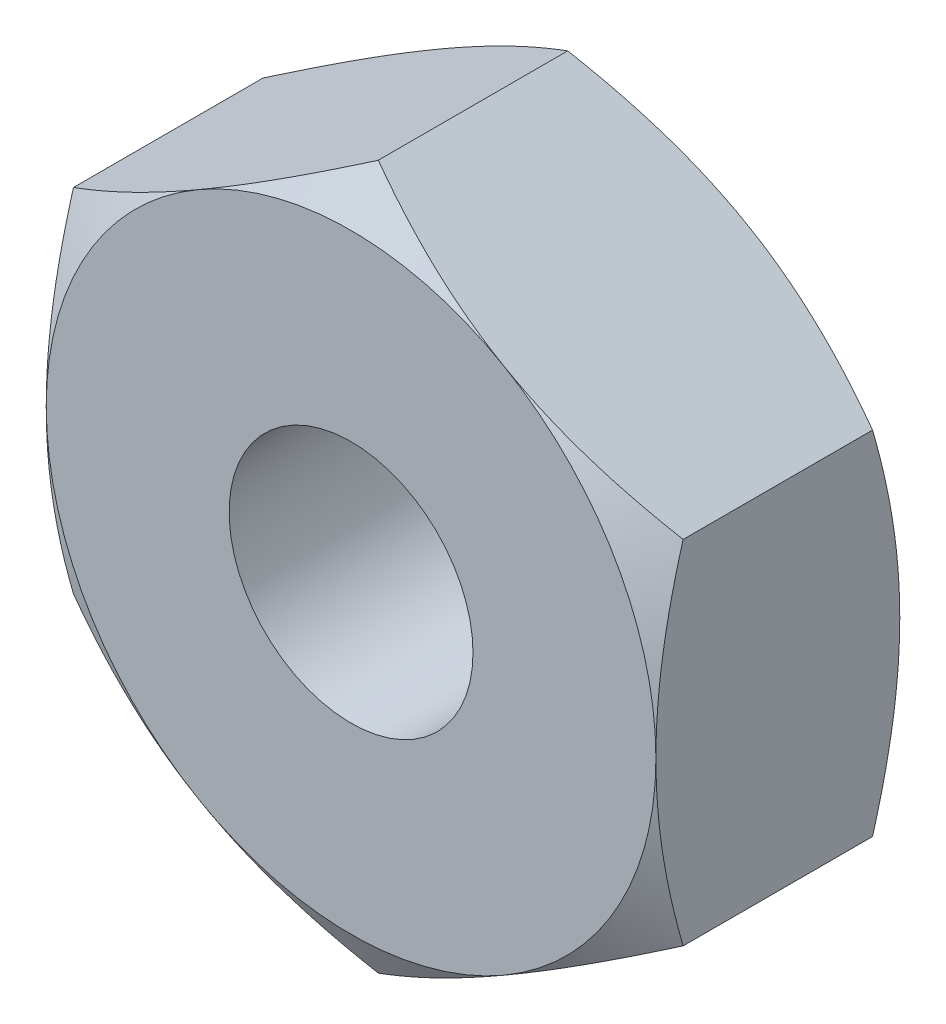
ISO-10303-21;
HEADER;
FILE_DESCRIPTION(('STEP AP214'),'2;1');
FILE_NAME('part.step','',(''),(''),'','','');
FILE_SCHEMA(('AUTOMOTIVE_DESIGN { 1 0 10303 214 1 1 1 1 }'));
ENDSEC;
DATA;
#1=APPLICATION_CONTEXT('core data for automotive mechanical design processes');
#2=APPLICATION_PROTOCOL_DEFINITION('international standard','automotive_design',2000,#1);
#3=PRODUCT_CONTEXT('',#1,'mechanical');
#4=PRODUCT('Part','Part','',(#3));
#5=PRODUCT_RELATED_PRODUCT_CATEGORY('part','',(#4));
#6=PRODUCT_DEFINITION_FORMATION('','',#4);
#7=PRODUCT_DEFINITION_CONTEXT('part definition',#1,'design');
#8=PRODUCT_DEFINITION('design','',#6,#7);
#9=PRODUCT_DEFINITION_SHAPE('','',#8);
#10=(LENGTH_UNIT() NAMED_UNIT(*) SI_UNIT(.MILLI.,.METRE.));
#11=(NAMED_UNIT(*) PLANE_ANGLE_UNIT() SI_UNIT($,.RADIAN.));
#12=(NAMED_UNIT(*) SI_UNIT($,.STERADIAN.) SOLID_ANGLE_UNIT());
#13=UNCERTAINTY_MEASURE_WITH_UNIT(LENGTH_MEASURE(1.E-05),#10,'distance_accuracy_value','');
#14=(GEOMETRIC_REPRESENTATION_CONTEXT(3) GLOBAL_UNCERTAINTY_ASSIGNED_CONTEXT((#13)) GLOBAL_UNIT_ASSIGNED_CONTEXT((#10,
#11,#12)) REPRESENTATION_CONTEXT('',''));
#15=CARTESIAN_POINT('',(0.,0.,0.));
#16=DIRECTION('',(0.,0.,1.));
#17=DIRECTION('',(1.,0.,0.));
#18=AXIS2_PLACEMENT_3D('',#15,#16,#17);
#19=CARTESIAN_POINT('',(-2.49999999999997,-1.44337567297409,2.));
#20=DIRECTION('',(0.499999999999995,0.866025403784441,0.));
#21=DIRECTION('',(-0.866025403784442,0.499999999999995,0.));
#22=AXIS2_PLACEMENT_3D('',#19,#20,#21);
#23=PLANE('',#22);
#24=CARTESIAN_POINT('',(0.000200000000000162,-2.88686681600195,0.2233576643591));
#25=CARTESIAN_POINT('',(-0.109663234734871,-2.82343724785373,0.186721620107618));
#26=CARTESIAN_POINT('',(-0.220474799896525,-2.75946016087833,0.153402218965049));
#27=CARTESIAN_POINT('',(-0.444016833466049,-2.63039810762177,0.0952422855578519));
#28=CARTESIAN_POINT('',(-0.556751274528388,-2.56531084772749,0.0704223291477331));
#29=CARTESIAN_POINT('',(-0.780822993875268,-2.43594298024479,0.0317856514410478));
#30=CARTESIAN_POINT('',(-0.892125791767376,-2.37168227992022,0.0177117961856351));
#31=CARTESIAN_POINT('',(-1.11525522746833,-2.24285844015414,0.000909152352747347));
#32=CARTESIAN_POINT('',(-1.22708105401423,-2.17829576909552,-0.00183354879637574));
#33=CARTESIAN_POINT('',(-1.43604197555152,-2.05765212479586,0.00386576000805192));
#34=CARTESIAN_POINT('',(-1.53320831755773,-2.0015531110824,0.0109083943818601));
#35=CARTESIAN_POINT('',(-1.72690794971099,-1.88972057631678,0.0332314191249406));
#36=CARTESIAN_POINT('',(-1.82344056965972,-1.83398744220381,0.0485194384402649));
#37=CARTESIAN_POINT('',(-2.01753972174046,-1.72192424450051,0.086739093844417));
#38=CARTESIAN_POINT('',(-2.11508168178212,-1.66560836761318,0.109832776125513));
#39=CARTESIAN_POINT('',(-2.30871060807606,-1.55381665489447,0.162246656577907));
#40=CARTESIAN_POINT('',(-2.40480005588615,-1.49833938633504,0.191554535624541));
#41=CARTESIAN_POINT('',(-2.50019999999997,-1.44326020292025,0.2233576643591));
#42=B_SPLINE_CURVE_WITH_KNOTS('',3,(#24,#25,#26,#27,#28,#29,#30,#31,#32,#33,#34,#35,#36,#37,#38,
#39,#40,#41),.UNSPECIFIED.,.F.,.F.,(4,2,2,2,2,2,2,2,4),(0.,0.396285827362224,0.793524330152047,
1.18093086852113,1.56786160134475,1.90479741793731,2.2420455166046,2.58677531536753,
2.93082800105252),.UNSPECIFIED.);
#43=CARTESIAN_POINT('',(0.,-2.88675134594811,0.223290993692593));
#44=VERTEX_POINT('',#43);
#45=CARTESIAN_POINT('',(-1.24999999999999,-2.1650635094611,0.));
#46=VERTEX_POINT('',#45);
#47=EDGE_CURVE('E266',#44,#46,#42,.T.);
#48=ORIENTED_EDGE('',*,*,#47,.F.);
#49=DIRECTION('',(0.,0.,-1.));
#50=VECTOR('',#49,1.);
#51=CARTESIAN_POINT('',(0.,-2.88675134594811,2.));
#52=LINE('',#51,#50);
#53=CARTESIAN_POINT('',(0.,-2.88675134594811,1.77670900630741));
#54=VERTEX_POINT('',#53);
#55=EDGE_CURVE('E309',#54,#44,#52,.T.);
#56=ORIENTED_EDGE('',*,*,#55,.F.);
#57=CARTESIAN_POINT('',(-2.50019999999997,-1.44326020292025,1.7766423356409));
#58=CARTESIAN_POINT('',(-2.3903367652651,-1.50668977106847,1.81327837989238));
#59=CARTESIAN_POINT('',(-2.27952520010345,-1.57066685804387,1.84659778103495));
#60=CARTESIAN_POINT('',(-2.05598316653392,-1.69972891130043,1.90475771444215));
#61=CARTESIAN_POINT('',(-1.94324872547158,-1.76481617119471,1.92957767085227));
#62=CARTESIAN_POINT('',(-1.7191770061247,-1.89418403867742,1.96821434855895));
#63=CARTESIAN_POINT('',(-1.60787420823259,-1.95844473900198,1.98228820381436));
#64=CARTESIAN_POINT('',(-1.38474477253164,-2.08726857876806,1.99909084764725));
#65=CARTESIAN_POINT('',(-1.27291894598575,-2.15183124982668,2.00183354879638));
#66=CARTESIAN_POINT('',(-1.06395802444845,-2.27247489412635,1.99613423999195));
#67=CARTESIAN_POINT('',(-0.966791682442246,-2.3285739078398,1.98909160561814));
#68=CARTESIAN_POINT('',(-0.773092050288979,-2.44040644260542,1.96676858087506));
#69=CARTESIAN_POINT('',(-0.676559430340252,-2.4961395767184,1.95148056155974));
#70=CARTESIAN_POINT('',(-0.482460278259513,-2.60820277442169,1.91326090615558));
#71=CARTESIAN_POINT('',(-0.38491831821785,-2.66451865130902,1.89016722387449));
#72=CARTESIAN_POINT('',(-0.19128939192391,-2.77631036402773,1.83775334342209));
#73=CARTESIAN_POINT('',(-0.0951999441138213,-2.83178763258716,1.80844546437546));
#74=CARTESIAN_POINT('',(0.000200000000000241,-2.88686681600195,1.7766423356409));
#75=B_SPLINE_CURVE_WITH_KNOTS('',3,(#57,#58,#59,#60,#61,#62,#63,#64,#65,#66,#67,#68,#69,#70,#71,
#72,#73,#74),.UNSPECIFIED.,.F.,.F.,(4,2,2,2,2,2,2,2,4),(0.,0.396285827362225,0.793524330152047,
1.18093086852113,1.56786160134475,1.90479741793731,2.2420455166046,2.58677531536753,
2.93082800105252),.UNSPECIFIED.);
#76=CARTESIAN_POINT('',(-1.24999999999999,-2.1650635094611,2.));
#77=VERTEX_POINT('',#76);
#78=EDGE_CURVE('E216',#77,#54,#75,.T.);
#79=ORIENTED_EDGE('',*,*,#78,.F.);
#80=CARTESIAN_POINT('',(-2.49999999999997,-1.44337567297421,1.77670900630749));
#81=VERTEX_POINT('',#80);
#82=EDGE_CURVE('E292',#81,#77,#75,.T.);
#83=ORIENTED_EDGE('',*,*,#82,.F.);
#84=DIRECTION('',(0.,0.,-1.));
#85=VECTOR('',#84,1.);
#86=CARTESIAN_POINT('',(-2.49999999999997,-1.44337567297409,2.));
#87=LINE('',#86,#85);
#88=CARTESIAN_POINT('',(-2.49999999999997,-1.44337567297421,0.223290993692512));
#89=VERTEX_POINT('',#88);
#90=EDGE_CURVE('E289',#81,#89,#87,.T.);
#91=ORIENTED_EDGE('',*,*,#90,.T.);
#92=EDGE_CURVE('E253',#46,#89,#42,.T.);
#93=ORIENTED_EDGE('',*,*,#92,.F.);
#94=EDGE_LOOP('',(#48,#56,#79,#83,#91,#93));
#95=FACE_BOUND('',#94,.T.);
#96=ADVANCED_FACE('F36',(#95),#23,.F.);
#97=CARTESIAN_POINT('',(0.,-2.88675134594811,2.));
#98=DIRECTION('',(-0.500000000000001,0.866025403784438,0.));
#99=DIRECTION('',(-0.866025403784438,-0.500000000000001,0.));
#100=AXIS2_PLACEMENT_3D('',#97,#98,#99);
#101=PLANE('',#100);
#102=CARTESIAN_POINT('',(2.50019999999999,-1.44326020292021,0.2233576643591));
#103=CARTESIAN_POINT('',(2.39033676526512,-1.50668977106843,0.186721620107618));
#104=CARTESIAN_POINT('',(2.27952520010347,-1.57066685804384,0.153402218965048));
#105=CARTESIAN_POINT('',(2.05598316653394,-1.6997289113004,0.0952422855578497));
#106=CARTESIAN_POINT('',(1.94324872547161,-1.76481617119468,0.0704223291477302));
#107=CARTESIAN_POINT('',(1.71917700612473,-1.89418403867739,0.0317856514410439));
#108=CARTESIAN_POINT('',(1.60787420823262,-1.95844473900195,0.0177117961856309));
#109=CARTESIAN_POINT('',(1.38474477253166,-2.08726857876803,0.000909152352742216));
#110=CARTESIAN_POINT('',(1.27291894598577,-2.15183124982665,-0.00183354879638143));
#111=CARTESIAN_POINT('',(1.06395802444848,-2.27247489412632,0.00386576000804523));
#112=CARTESIAN_POINT('',(0.966791682442268,-2.32857390783978,0.0109083943818532));
#113=CARTESIAN_POINT('',(0.773092050288997,-2.4404064426054,0.033231419124934));
#114=CARTESIAN_POINT('',(0.676559430340268,-2.49613957671838,0.0485194384402587));
#115=CARTESIAN_POINT('',(0.482460278259524,-2.60820277442168,0.0867390938444119));
#116=CARTESIAN_POINT('',(0.384918318217859,-2.66451865130902,0.109832776125509));
#117=CARTESIAN_POINT('',(0.191289391923915,-2.77631036402772,0.162246656577905));
#118=CARTESIAN_POINT('',(0.0951999441138241,-2.83178763258716,0.19155453562454));
#119=CARTESIAN_POINT('',(-0.000199999999999883,-2.88686681600195,0.2233576643591));
#120=B_SPLINE_CURVE_WITH_KNOTS('',3,(#102,#103,#104,#105,#106,#107,#108,#109,#110,#111,#112,
#113,#114,#115,#116,#117,#118,#119),.UNSPECIFIED.,.F.,.F.,(4,2,2,2,2,2,2,2,4),(0.,
0.396285827362225,0.793524330152047,1.18093086852113,1.56786160134475,1.90479741793732,
2.24204551660462,2.58677531536755,2.93082800105256),.UNSPECIFIED.);
#121=CARTESIAN_POINT('',(2.49999999999999,-1.44337567297405,0.223290993692593));
#122=VERTEX_POINT('',#121);
#123=CARTESIAN_POINT('',(1.25,-2.1650635094611,0.));
#124=VERTEX_POINT('',#123);
#125=EDGE_CURVE('E144',#122,#124,#120,.T.);
#126=ORIENTED_EDGE('',*,*,#125,.F.);
#127=DIRECTION('',(0.,0.,-1.));
#128=VECTOR('',#127,1.);
#129=CARTESIAN_POINT('',(2.49999999999999,-1.44337567297405,2.));
#130=LINE('',#129,#128);
#131=CARTESIAN_POINT('',(2.49999999999999,-1.44337567297417,1.77670900630749));
#132=VERTEX_POINT('',#131);
#133=EDGE_CURVE('E156',#132,#122,#130,.T.);
#134=ORIENTED_EDGE('',*,*,#133,.F.);
#135=CARTESIAN_POINT('',(-0.000200000000000074,-2.88686681600195,1.7766423356409));
#136=CARTESIAN_POINT('',(0.10966323473487,-2.82343724785373,1.81327837989238));
#137=CARTESIAN_POINT('',(0.220474799896524,-2.75946016087833,1.84659778103495));
#138=CARTESIAN_POINT('',(0.444016833466047,-2.63039810762177,1.90475771444215));
#139=CARTESIAN_POINT('',(0.556751274528385,-2.56531084772748,1.92957767085227));
#140=CARTESIAN_POINT('',(0.780822993875264,-2.43594298024478,1.96821434855896));
#141=CARTESIAN_POINT('',(0.892125791767372,-2.37168227992021,1.98228820381437));
#142=CARTESIAN_POINT('',(1.11525522746833,-2.24285844015414,1.99909084764726));
#143=CARTESIAN_POINT('',(1.22708105401422,-2.17829576909551,2.00183354879638));
#144=CARTESIAN_POINT('',(1.43604197555151,-2.05765212479585,1.99613423999195));
#145=CARTESIAN_POINT('',(1.53320831755772,-2.00155311108239,1.98909160561815));
#146=CARTESIAN_POINT('',(1.72690794971099,-1.88972057631677,1.96676858087507));
#147=CARTESIAN_POINT('',(1.82344056965972,-1.83398744220379,1.95148056155974));
#148=CARTESIAN_POINT('',(2.01753972174047,-1.72192424450049,1.91326090615559));
#149=CARTESIAN_POINT('',(2.11508168178213,-1.66560836761315,1.89016722387449));
#150=CARTESIAN_POINT('',(2.30871060807608,-1.55381665489444,1.8377533434221));
#151=CARTESIAN_POINT('',(2.40480005588617,-1.49833938633501,1.80844546437546));
#152=CARTESIAN_POINT('',(2.50019999999999,-1.44326020292021,1.7766423356409));
#153=B_SPLINE_CURVE_WITH_KNOTS('',3,(#135,#136,#137,#138,#139,#140,#141,#142,#143,#144,#145,
#146,#147,#148,#149,#150,#151,#152),.UNSPECIFIED.,.F.,.F.,(4,2,2,2,2,2,2,2,4),(0.,
0.396285827362224,0.793524330152047,1.18093086852113,1.56786160134475,1.90479741793732,
2.24204551660462,2.58677531536755,2.93082800105256),.UNSPECIFIED.);
#154=CARTESIAN_POINT('',(1.25,-2.16506350946108,2.));
#155=VERTEX_POINT('',#154);
#156=EDGE_CURVE('E199',#155,#132,#153,.T.);
#157=ORIENTED_EDGE('',*,*,#156,.F.);
#158=EDGE_CURVE('E333',#54,#155,#153,.T.);
#159=ORIENTED_EDGE('',*,*,#158,.F.);
#160=ORIENTED_EDGE('',*,*,#55,.T.);
#161=EDGE_CURVE('E166',#124,#44,#120,.T.);
#162=ORIENTED_EDGE('',*,*,#161,.F.);
#163=EDGE_LOOP('',(#126,#134,#157,#159,#160,#162));
#164=FACE_BOUND('',#163,.T.);
#165=ADVANCED_FACE('F179',(#164),#101,.F.);
#166=CARTESIAN_POINT('',(2.49999999999999,-1.44337567297405,2.));
#167=DIRECTION('',(-1.,0.,0.));
#168=DIRECTION('',(0.,-1.,0.));
#169=AXIS2_PLACEMENT_3D('',#166,#167,#168);
#170=PLANE('',#169);
#171=CARTESIAN_POINT('',(2.5,-3.93425573570174,1.24786742231988));
#172=CARTESIAN_POINT('',(2.5,-3.82455805271518,1.19442683286789));
#173=CARTESIAN_POINT('',(2.5,-3.71461458124995,1.1414824250811));
#174=CARTESIAN_POINT('',(2.5,-3.49410553801961,1.03686398179162));
#175=CARTESIAN_POINT('',(2.5,-3.38353987636771,0.985190135952728));
#176=CARTESIAN_POINT('',(2.5,-3.1611133721341,0.883143029913734));
#177=CARTESIAN_POINT('',(2.5,-3.04924878665415,0.832777900698826));
#178=CARTESIAN_POINT('',(2.5,-2.8246495074574,0.734034164431113));
#179=CARTESIAN_POINT('',(2.5,-2.71191485354297,0.685655467138938));
#180=CARTESIAN_POINT('',(2.49999999999999,-2.4815726289783,0.589816347587659));
#181=CARTESIAN_POINT('',(2.49999999999999,-2.36392903093314,0.542442056681136));
#182=CARTESIAN_POINT('',(2.49999999999999,-2.12728680673992,0.451142480581939));
#183=CARTESIAN_POINT('',(2.49999999999999,-2.00828803339158,0.407217574235718));
#184=CARTESIAN_POINT('',(2.49999999999999,-1.76895086303134,0.323927966543298));
#185=CARTESIAN_POINT('',(2.49999999999999,-1.64861554144244,0.284554513885219));
#186=CARTESIAN_POINT('',(2.49999999999999,-1.40621964850133,0.21159319438697));
#187=CARTESIAN_POINT('',(2.49999999999999,-1.28415961496497,0.178003565258964));
#188=CARTESIAN_POINT('',(2.49999999999999,-1.0389195188697,0.118361804718263));
#189=CARTESIAN_POINT('',(2.49999999999999,-0.915749874741587,0.0922676059427502));
#190=CARTESIAN_POINT('',(2.49999999999999,-0.667820858109997,0.0490550373819117));
#191=CARTESIAN_POINT('',(2.49999999999999,-0.543061659325973,0.0319356952253109));
#192=CARTESIAN_POINT('',(2.49999999999999,-0.294229286789481,0.00825976303698975));
#193=CARTESIAN_POINT('',(2.49999999999999,-0.170169796196182,0.0015629187993084));
#194=CARTESIAN_POINT('',(2.49999999999999,0.0780766731615942,-0.00107330125971436));
#195=CARTESIAN_POINT('',(2.49999999999999,0.202263653840971,0.00298748693341116));
#196=CARTESIAN_POINT('',(2.49999999999998,0.411409604725348,0.0185927331632678));
#197=CARTESIAN_POINT('',(2.49999999999998,0.496584671497748,0.0274243081141329));
#198=CARTESIAN_POINT('',(2.49999999999998,0.666344730959548,0.0496284777980075));
#199=CARTESIAN_POINT('',(2.49999999999998,0.750929648415659,0.063001641083345));
#200=CARTESIAN_POINT('',(2.49999999999998,1.00366548007522,0.109234028667318));
#201=CARTESIAN_POINT('',(2.49999999999998,1.17071375552299,0.148199044449048));
#202=CARTESIAN_POINT('',(2.49999999999998,1.4206286514283,0.216203518781425));
#203=CARTESIAN_POINT('',(2.49999999999998,1.50477790209398,0.240801494595756));
#204=CARTESIAN_POINT('',(2.49999999999998,1.67225987920894,0.292660070165323));
#205=CARTESIAN_POINT('',(2.49999999999998,1.75559259937951,0.319920690377339));
#206=CARTESIAN_POINT('',(2.49999999999998,1.92146681890304,0.376658162164918));
#207=CARTESIAN_POINT('',(2.49999999999998,2.00400853495824,0.406134385980853));
#208=CARTESIAN_POINT('',(2.49999999999998,2.16840002368736,0.466945522238705));
#209=CARTESIAN_POINT('',(2.49999999999998,2.25024981200959,0.498280392517164));
#210=CARTESIAN_POINT('',(2.49999999999998,2.47007598379912,0.584843598085943));
#211=CARTESIAN_POINT('',(2.49999999999998,2.60747896260624,0.641526709598319));
#212=CARTESIAN_POINT('',(2.49999999999998,2.88087320813983,0.758212721815775));
#213=CARTESIAN_POINT('',(2.49999999999998,3.01686431759797,0.818215987739867));
#214=CARTESIAN_POINT('',(2.49999999999997,3.28775371033888,0.940755016909798));
#215=CARTESIAN_POINT('',(2.49999999999997,3.42265159883759,1.00329165002619));
#216=CARTESIAN_POINT('',(2.49999999999997,3.69153349617871,1.13030325926438));
#217=CARTESIAN_POINT('',(2.49999999999997,3.82551747693042,1.19477829464024));
#218=CARTESIAN_POINT('',(2.49999999999997,4.22678780318403,1.39065285591914));
#219=CARTESIAN_POINT('',(2.49999999999997,4.49297167508688,1.52430796749618));
#220=CARTESIAN_POINT('',(2.49999999999997,5.02332787108775,1.79538779124832));
#221=CARTESIAN_POINT('',(2.49999999999997,5.28750060208648,1.93281171353398));
#222=CARTESIAN_POINT('',(2.49999999999997,5.78669441053013,2.19560284746361));
#223=CARTESIAN_POINT('',(2.49999999999997,6.02185115865901,2.32071278514315));
#224=CARTESIAN_POINT('',(2.49999999999996,6.49137306636739,2.57244119196158));
#225=CARTESIAN_POINT('',(2.49999999999996,6.7257381764787,2.69905975321281));
#226=CARTESIAN_POINT('',(2.49999999999996,7.19307672107728,2.95299069470952));
#227=CARTESIAN_POINT('',(2.49999999999996,7.42605218847075,3.08029933799));
#228=CARTESIAN_POINT('',(2.49999999999996,7.89150863123006,3.33577450416362));
#229=CARTESIAN_POINT('',(2.49999999999996,8.12398964405185,3.46394095878685));
#230=CARTESIAN_POINT('',(2.49999999999996,8.35629687842252,3.59241944863064));
#231=B_SPLINE_CURVE_WITH_KNOTS('',3,(#171,#172,#173,#174,#175,#176,#177,#178,#179,#180,#181,
#182,#183,#184,#185,#186,#187,#188,#189,#190,#191,#192,#193,#194,#195,#196,#197,#198,#199,#200,
#201,#202,#203,#204,#205,#206,#207,#208,#209,#210,#211,#212,#213,#214,#215,#216,#217,#218,#219,
#220,#221,#222,#223,#224,#225,#226,#227,#228,#229,#230),.UNSPECIFIED.,.F.,.F.,(4,2,2,2,2,2,2,2,
2,2,2,2,2,2,2,2,2,2,2,2,2,2,2,2,2,2,2,2,2,4),(0.,0.366071555956611,0.732197429693603,
1.10022131466406,1.46822846255462,1.84865877257403,2.22913080704688,2.60885867248576,
2.98847063215674,3.36590845840163,3.74330538309199,4.11557841167118,4.4878571160823,
4.74462879425845,5.00143262902233,5.51529120295764,5.7782794978535,6.04126981341614,
6.30418589329148,6.56709601118611,7.01293774320754,7.45882861596655,7.9048739119297,
8.35093285672014,9.24444046413292,10.1377622149405,10.9368546431961,11.7359961144143,
12.5324647674532,13.3288707690047),.UNSPECIFIED.);
#232=CARTESIAN_POINT('',(2.49999999999998,1.44337567297407,0.223290993692593));
#233=VERTEX_POINT('',#232);
#234=CARTESIAN_POINT('',(2.5,0.,0.));
#235=VERTEX_POINT('',#234);
#236=EDGE_CURVE('E125',#233,#235,#231,.F.);
#237=ORIENTED_EDGE('',*,*,#236,.F.);
#238=DIRECTION('',(0.,0.,-1.));
#239=VECTOR('',#238,1.);
#240=CARTESIAN_POINT('',(2.49999999999998,1.44337567297407,2.));
#241=LINE('',#240,#239);
#242=CARTESIAN_POINT('',(2.49999999999998,1.44337567297407,1.77670900630741));
#243=VERTEX_POINT('',#242);
#244=EDGE_CURVE('E307',#243,#233,#241,.T.);
#245=ORIENTED_EDGE('',*,*,#244,.F.);
#246=CARTESIAN_POINT('',(2.5,-3.93425573570174,0.752132577680122));
#247=CARTESIAN_POINT('',(2.5,-3.82455805271518,0.805573167132106));
#248=CARTESIAN_POINT('',(2.5,-3.71461458124995,0.858517574918903));
#249=CARTESIAN_POINT('',(2.5,-3.49410553801961,0.96313601820838));
#250=CARTESIAN_POINT('',(2.5,-3.3835398763677,1.01480986404727));
#251=CARTESIAN_POINT('',(2.5,-3.1611133721341,1.11685697008627));
#252=CARTESIAN_POINT('',(2.5,-3.04924878665415,1.16722209930117));
#253=CARTESIAN_POINT('',(2.5,-2.8246495074574,1.26596583556889));
#254=CARTESIAN_POINT('',(2.5,-2.71191485354297,1.31434453286106));
#255=CARTESIAN_POINT('',(2.49999999999999,-2.4815726289783,1.41018365241234));
#256=CARTESIAN_POINT('',(2.49999999999999,-2.36392903093314,1.45755794331886));
#257=CARTESIAN_POINT('',(2.49999999999999,-2.12728680673992,1.54885751941806));
#258=CARTESIAN_POINT('',(2.49999999999999,-2.00828803339158,1.59278242576428));
#259=CARTESIAN_POINT('',(2.49999999999999,-1.76895086303134,1.6760720334567));
#260=CARTESIAN_POINT('',(2.49999999999999,-1.64861554144244,1.71544548611478));
#261=CARTESIAN_POINT('',(2.49999999999999,-1.40621964850133,1.78840680561303));
#262=CARTESIAN_POINT('',(2.49999999999999,-1.28415961496497,1.82199643474104));
#263=CARTESIAN_POINT('',(2.49999999999999,-1.0389195188697,1.88163819528174));
#264=CARTESIAN_POINT('',(2.49999999999999,-0.915749874741587,1.90773239405725));
#265=CARTESIAN_POINT('',(2.49999999999999,-0.667820858109997,1.95094496261809));
#266=CARTESIAN_POINT('',(2.49999999999999,-0.543061659325972,1.96806430477469));
#267=CARTESIAN_POINT('',(2.49999999999999,-0.294229286789481,1.99174023696301));
#268=CARTESIAN_POINT('',(2.49999999999999,-0.170169796196181,1.99843708120069));
#269=CARTESIAN_POINT('',(2.49999999999999,0.0780766731615949,2.00107330125971));
#270=CARTESIAN_POINT('',(2.49999999999999,0.202263653840971,1.99701251306659));
#271=CARTESIAN_POINT('',(2.49999999999998,0.411409604725348,1.98140726683673));
#272=CARTESIAN_POINT('',(2.49999999999998,0.496584671497748,1.97257569188587));
#273=CARTESIAN_POINT('',(2.49999999999998,0.666344730959547,1.95037152220199));
#274=CARTESIAN_POINT('',(2.49999999999998,0.750929648415658,1.93699835891666));
#275=CARTESIAN_POINT('',(2.49999999999998,1.00366548007522,1.89076597133268));
#276=CARTESIAN_POINT('',(2.49999999999998,1.17071375552299,1.85180095555095));
#277=CARTESIAN_POINT('',(2.49999999999998,1.4206286514283,1.78379648121857));
#278=CARTESIAN_POINT('',(2.49999999999998,1.50477790209398,1.75919850540424));
#279=CARTESIAN_POINT('',(2.49999999999998,1.67225987920894,1.70733992983468));
#280=CARTESIAN_POINT('',(2.49999999999998,1.75559259937951,1.68007930962266));
#281=CARTESIAN_POINT('',(2.49999999999998,1.92146681890304,1.62334183783508));
#282=CARTESIAN_POINT('',(2.49999999999998,2.00400853495824,1.59386561401915));
#283=CARTESIAN_POINT('',(2.49999999999998,2.16840002368736,1.53305447776129));
#284=CARTESIAN_POINT('',(2.49999999999998,2.25024981200959,1.50171960748284));
#285=CARTESIAN_POINT('',(2.49999999999998,2.47007598379913,1.41515640191406));
#286=CARTESIAN_POINT('',(2.49999999999998,2.60747896260624,1.35847329040168));
#287=CARTESIAN_POINT('',(2.49999999999998,2.88087320813983,1.24178727818422));
#288=CARTESIAN_POINT('',(2.49999999999998,3.01686431759797,1.18178401226013));
#289=CARTESIAN_POINT('',(2.49999999999997,3.28775371033888,1.0592449830902));
#290=CARTESIAN_POINT('',(2.49999999999997,3.42265159883759,0.996708349973814));
#291=CARTESIAN_POINT('',(2.49999999999997,3.69153349617871,0.86969674073562));
#292=CARTESIAN_POINT('',(2.49999999999997,3.82551747693042,0.805221705359762));
#293=CARTESIAN_POINT('',(2.49999999999997,4.22678780318403,0.609347144080856));
#294=CARTESIAN_POINT('',(2.49999999999997,4.49297167508688,0.475692032503817));
#295=CARTESIAN_POINT('',(2.49999999999997,5.02332787108775,0.204612208751678));
#296=CARTESIAN_POINT('',(2.49999999999997,5.28750060208648,0.0671882864660215));
#297=CARTESIAN_POINT('',(2.49999999999997,5.78669441053013,-0.195602847463607));
#298=CARTESIAN_POINT('',(2.49999999999997,6.02185115865901,-0.320712785143147));
#299=CARTESIAN_POINT('',(2.49999999999996,6.49137306636739,-0.572441191961576));
#300=CARTESIAN_POINT('',(2.49999999999996,6.7257381764787,-0.699059753212815));
#301=CARTESIAN_POINT('',(2.49999999999996,7.19307672107728,-0.952990694709516));
#302=CARTESIAN_POINT('',(2.49999999999996,7.42605218847075,-1.08029933799));
#303=CARTESIAN_POINT('',(2.49999999999996,7.89150863123006,-1.33577450416362));
#304=CARTESIAN_POINT('',(2.49999999999996,8.12398964405185,-1.46394095878685));
#305=CARTESIAN_POINT('',(2.49999999999996,8.35629687842252,-1.59241944863064));
#306=B_SPLINE_CURVE_WITH_KNOTS('',3,(#246,#247,#248,#249,#250,#251,#252,#253,#254,#255,#256,
#257,#258,#259,#260,#261,#262,#263,#264,#265,#266,#267,#268,#269,#270,#271,#272,#273,#274,#275,
#276,#277,#278,#279,#280,#281,#282,#283,#284,#285,#286,#287,#288,#289,#290,#291,#292,#293,#294,
#295,#296,#297,#298,#299,#300,#301,#302,#303,#304,#305),.UNSPECIFIED.,.F.,.F.,(4,2,2,2,2,2,2,2,
2,2,2,2,2,2,2,2,2,2,2,2,2,2,2,2,2,2,2,2,2,4),(0.,0.366071555956611,0.732197429693603,
1.10022131466407,1.46822846255462,1.84865877257403,2.22913080704688,2.60885867248576,
2.98847063215674,3.36590845840163,3.74330538309199,4.11557841167118,4.4878571160823,
4.74462879425845,5.00143262902233,5.51529120295764,5.7782794978535,6.04126981341614,
6.30418589329148,6.56709601118611,7.01293774320754,7.45882861596655,7.9048739119297,
8.35093285672014,9.24444046413292,10.1377622149405,10.9368546431961,11.7359961144143,
12.5324647674532,13.3288707690047),.UNSPECIFIED.);
#307=CARTESIAN_POINT('',(2.49999999999999,0.,2.));
#308=VERTEX_POINT('',#307);
#309=EDGE_CURVE('E185',#308,#243,#306,.T.);
#310=ORIENTED_EDGE('',*,*,#309,.F.);
#311=EDGE_CURVE('E192',#132,#308,#306,.T.);
#312=ORIENTED_EDGE('',*,*,#311,.F.);
#313=ORIENTED_EDGE('',*,*,#133,.T.);
#314=EDGE_CURVE('E137',#235,#122,#231,.F.);
#315=ORIENTED_EDGE('',*,*,#314,.F.);
#316=EDGE_LOOP('',(#237,#245,#310,#312,#313,#315));
#317=FACE_BOUND('',#316,.T.);
#318=ADVANCED_FACE('F153',(#317),#170,.F.);
#319=CARTESIAN_POINT('',(2.49999999999998,1.44337567297407,2.));
#320=DIRECTION('',(-0.499999999999995,-0.866025403784442,0.));
#321=DIRECTION('',(0.866025403784442,-0.499999999999995,0.));
#322=AXIS2_PLACEMENT_3D('',#319,#320,#321);
#323=PLANE('',#322);
#324=CARTESIAN_POINT('',(-0.000200000000020158,2.88686681600195,0.2233576643591));
#325=CARTESIAN_POINT('',(0.109663234734851,2.82343724785373,0.186721620107617));
#326=CARTESIAN_POINT('',(0.220474799896505,2.75946016087833,0.153402218965048));
#327=CARTESIAN_POINT('',(0.444016833466029,2.63039810762177,0.0952422855578498));
#328=CARTESIAN_POINT('',(0.556751274528367,2.56531084772749,0.0704223291477303));
#329=CARTESIAN_POINT('',(0.780822993875247,2.43594298024479,0.0317856514410441));
#330=CARTESIAN_POINT('',(0.892125791767355,2.37168227992022,0.017711796185631));
#331=CARTESIAN_POINT('',(1.11525522746831,2.24285844015414,0.000909152352742206));
#332=CARTESIAN_POINT('',(1.2270810540142,2.17829576909552,-0.00183354879638151));
#333=CARTESIAN_POINT('',(1.4360419755515,2.05765212479586,0.00386576000804518));
#334=CARTESIAN_POINT('',(1.53320831755771,2.0015531110824,0.0109083943818533));
#335=CARTESIAN_POINT('',(1.72690794971098,1.88972057631678,0.033231419124934));
#336=CARTESIAN_POINT('',(1.82344056965971,1.8339874422038,0.0485194384402585));
#337=CARTESIAN_POINT('',(2.01753972174046,1.7219242445005,0.0867390938444117));
#338=CARTESIAN_POINT('',(2.11508168178212,1.66560836761317,0.109832776125508));
#339=CARTESIAN_POINT('',(2.30871060807607,1.55381665489446,0.162246656577905));
#340=CARTESIAN_POINT('',(2.40480005588616,1.49833938633502,0.19155453562454));
#341=CARTESIAN_POINT('',(2.50019999999998,1.44326020292023,0.2233576643591));
#342=B_SPLINE_CURVE_WITH_KNOTS('',3,(#324,#325,#326,#327,#328,#329,#330,#331,#332,#333,#334,
#335,#336,#337,#338,#339,#340,#341),.UNSPECIFIED.,.F.,.F.,(4,2,2,2,2,2,2,2,4),(0.,
0.396285827362224,0.793524330152047,1.18093086852113,1.56786160134475,1.90479741793732,
2.24204551660462,2.58677531536755,2.93082800105256),.UNSPECIFIED.);
#343=CARTESIAN_POINT('',(0.,2.88675134594811,0.223290993692593));
#344=VERTEX_POINT('',#343);
#345=CARTESIAN_POINT('',(1.24999999999999,2.1650635094611,0.));
#346=VERTEX_POINT('',#345);
#347=EDGE_CURVE('E52',#344,#346,#342,.T.);
#348=ORIENTED_EDGE('',*,*,#347,.F.);
#349=DIRECTION('',(0.,0.,-1.));
#350=VECTOR('',#349,1.);
#351=CARTESIAN_POINT('',(0.,2.88675134594811,2.));
#352=LINE('',#351,#350);
#353=CARTESIAN_POINT('',(0.,2.88675134594811,1.77670900630741));
#354=VERTEX_POINT('',#353);
#355=EDGE_CURVE('E299',#354,#344,#352,.T.);
#356=ORIENTED_EDGE('',*,*,#355,.F.);
#357=CARTESIAN_POINT('',(2.50019999999998,1.44326020292023,1.7766423356409));
#358=CARTESIAN_POINT('',(2.39033676526511,1.50668977106845,1.81327837989238));
#359=CARTESIAN_POINT('',(2.27952520010346,1.57066685804385,1.84659778103495));
#360=CARTESIAN_POINT('',(2.05598316653393,1.69972891130041,1.90475771444215));
#361=CARTESIAN_POINT('',(1.94324872547159,1.7648161711947,1.92957767085227));
#362=CARTESIAN_POINT('',(1.71917700612471,1.8941840386774,1.96821434855896));
#363=CARTESIAN_POINT('',(1.60787420823261,1.95844473900196,1.98228820381437));
#364=CARTESIAN_POINT('',(1.38474477253165,2.08726857876804,1.99909084764726));
#365=CARTESIAN_POINT('',(1.27291894598576,2.15183124982666,2.00183354879638));
#366=CARTESIAN_POINT('',(1.06395802444846,2.27247489412633,1.99613423999195));
#367=CARTESIAN_POINT('',(0.966791682442252,2.32857390783979,1.98909160561815));
#368=CARTESIAN_POINT('',(0.77309205028898,2.44040644260541,1.96676858087507));
#369=CARTESIAN_POINT('',(0.67655943034025,2.49613957671839,1.95148056155974));
#370=CARTESIAN_POINT('',(0.482460278259505,2.60820277442168,1.91326090615559));
#371=CARTESIAN_POINT('',(0.384918318217841,2.66451865130902,1.89016722387449));
#372=CARTESIAN_POINT('',(0.191289391923895,2.77631036402772,1.8377533434221));
#373=CARTESIAN_POINT('',(0.0951999441138043,2.83178763258716,1.80844546437546));
#374=CARTESIAN_POINT('',(-0.000200000000020008,2.88686681600195,1.7766423356409));
#375=B_SPLINE_CURVE_WITH_KNOTS('',3,(#357,#358,#359,#360,#361,#362,#363,#364,#365,#366,#367,
#368,#369,#370,#371,#372,#373,#374),.UNSPECIFIED.,.F.,.F.,(4,2,2,2,2,2,2,2,4),(0.,
0.396285827362225,0.793524330152047,1.18093086852113,1.56786160134475,1.90479741793732,
2.24204551660462,2.58677531536755,2.93082800105256),.UNSPECIFIED.);
#376=CARTESIAN_POINT('',(1.24999999999998,2.16506350946109,2.));
#377=VERTEX_POINT('',#376);
#378=EDGE_CURVE('E194',#377,#354,#375,.T.);
#379=ORIENTED_EDGE('',*,*,#378,.F.);
#380=EDGE_CURVE('E193',#243,#377,#375,.T.);
#381=ORIENTED_EDGE('',*,*,#380,.F.);
#382=ORIENTED_EDGE('',*,*,#244,.T.);
#383=EDGE_CURVE('E131',#346,#233,#342,.T.);
#384=ORIENTED_EDGE('',*,*,#383,.F.);
#385=EDGE_LOOP('',(#348,#356,#379,#381,#382,#384));
#386=FACE_BOUND('',#385,.T.);
#387=ADVANCED_FACE('F178',(#386),#323,.F.);
#388=CARTESIAN_POINT('',(0.,2.88675134594811,2.));
#389=DIRECTION('',(0.500000000000007,-0.866025403784435,0.));
#390=DIRECTION('',(0.866025403784434,0.500000000000007,0.));
#391=AXIS2_PLACEMENT_3D('',#388,#389,#390);
#392=PLANE('',#391);
#393=CARTESIAN_POINT('',(-2.5002,1.4432602029202,0.2233576643591));
#394=CARTESIAN_POINT('',(-2.39033676526513,1.50668977106842,0.186721620107617));
#395=CARTESIAN_POINT('',(-2.27952520010348,1.57066685804382,0.153402218965048));
#396=CARTESIAN_POINT('',(-2.05598316653396,1.69972891130039,0.0952422855578498));
#397=CARTESIAN_POINT('',(-1.94324872547162,1.76481617119467,0.0704223291477304));
#398=CARTESIAN_POINT('',(-1.71917700612474,1.89418403867737,0.0317856514410441));
#399=CARTESIAN_POINT('',(-1.60787420823263,1.95844473900194,0.0177117961856308));
#400=CARTESIAN_POINT('',(-1.38474477253168,2.08726857876802,0.000909152352742026));
#401=CARTESIAN_POINT('',(-1.27291894598579,2.15183124982664,-0.00183354879638151));
#402=CARTESIAN_POINT('',(-1.0639580244485,2.27247489412631,0.00386576000804529));
#403=CARTESIAN_POINT('',(-0.966791682442284,2.32857390783977,0.0109083943818533));
#404=CARTESIAN_POINT('',(-0.773092050289014,2.4404064426054,0.0332314191249341));
#405=CARTESIAN_POINT('',(-0.676559430340285,2.49613957671838,0.0485194384402587));
#406=CARTESIAN_POINT('',(-0.482460278259542,2.60820277442167,0.0867390938444119));
#407=CARTESIAN_POINT('',(-0.384918318217878,2.66451865130901,0.109832776125509));
#408=CARTESIAN_POINT('',(-0.191289391923934,2.77631036402772,0.162246656577905));
#409=CARTESIAN_POINT('',(-0.0951999441138436,2.83178763258716,0.19155453562454));
#410=CARTESIAN_POINT('',(0.000199999999980036,2.88686681600195,0.2233576643591));
#411=B_SPLINE_CURVE_WITH_KNOTS('',3,(#393,#394,#395,#396,#397,#398,#399,#400,#401,#402,#403,
#404,#405,#406,#407,#408,#409,#410),.UNSPECIFIED.,.F.,.F.,(4,2,2,2,2,2,2,2,4),(0.,
0.396285827362225,0.793524330152046,1.18093086852113,1.56786160134475,1.90479741793732,
2.24204551660462,2.58677531536755,2.93082800105256),.UNSPECIFIED.);
#412=CARTESIAN_POINT('',(-2.5,1.44337567297403,0.223290993692593));
#413=VERTEX_POINT('',#412);
#414=CARTESIAN_POINT('',(-1.25000000000002,2.16506350946109,0.));
#415=VERTEX_POINT('',#414);
#416=EDGE_CURVE('E59',#413,#415,#411,.T.);
#417=ORIENTED_EDGE('',*,*,#416,.F.);
#418=DIRECTION('',(0.,0.,-1.));
#419=VECTOR('',#418,1.);
#420=CARTESIAN_POINT('',(-2.5,1.44337567297403,2.));
#421=LINE('',#420,#419);
#422=CARTESIAN_POINT('',(-2.5,1.44337567297403,1.77670900630741));
#423=VERTEX_POINT('',#422);
#424=EDGE_CURVE('E295',#423,#413,#421,.T.);
#425=ORIENTED_EDGE('',*,*,#424,.F.);
#426=CARTESIAN_POINT('',(0.000199999999979915,2.88686681600195,1.7766423356409));
#427=CARTESIAN_POINT('',(-0.10966323473489,2.82343724785373,1.81327837989238));
#428=CARTESIAN_POINT('',(-0.220474799896544,2.75946016087833,1.84659778103495));
#429=CARTESIAN_POINT('',(-0.444016833466065,2.63039810762176,1.90475771444215));
#430=CARTESIAN_POINT('',(-0.556751274528403,2.56531084772748,1.92957767085227));
#431=CARTESIAN_POINT('',(-0.780822993875281,2.43594298024477,1.96821434855896));
#432=CARTESIAN_POINT('',(-0.892125791767388,2.37168227992021,1.98228820381437));
#433=CARTESIAN_POINT('',(-1.11525522746834,2.24285844015413,1.99909084764726));
#434=CARTESIAN_POINT('',(-1.22708105401423,2.17829576909551,2.00183354879638));
#435=CARTESIAN_POINT('',(-1.43604197555153,2.05765212479584,1.99613423999195));
#436=CARTESIAN_POINT('',(-1.53320831755774,2.00155311108238,1.98909160561815));
#437=CARTESIAN_POINT('',(-1.72690794971101,1.88972057631675,1.96676858087507));
#438=CARTESIAN_POINT('',(-1.82344056965974,1.83398744220377,1.95148056155974));
#439=CARTESIAN_POINT('',(-2.01753972174048,1.72192424450048,1.91326090615559));
#440=CARTESIAN_POINT('',(-2.11508168178214,1.66560836761314,1.89016722387449));
#441=CARTESIAN_POINT('',(-2.30871060807609,1.55381665489443,1.8377533434221));
#442=CARTESIAN_POINT('',(-2.40480005588618,1.49833938633499,1.80844546437546));
#443=CARTESIAN_POINT('',(-2.5002,1.4432602029202,1.7766423356409));
#444=B_SPLINE_CURVE_WITH_KNOTS('',3,(#426,#427,#428,#429,#430,#431,#432,#433,#434,#435,#436,
#437,#438,#439,#440,#441,#442,#443),.UNSPECIFIED.,.F.,.F.,(4,2,2,2,2,2,2,2,4),(0.,
0.396285827362225,0.793524330152047,1.18093086852113,1.56786160134475,1.90479741793732,
2.24204551660462,2.58677531536755,2.93082800105256),.UNSPECIFIED.);
#445=CARTESIAN_POINT('',(-1.25000000000001,2.16506350946107,2.));
#446=VERTEX_POINT('',#445);
#447=EDGE_CURVE('E232',#446,#423,#444,.T.);
#448=ORIENTED_EDGE('',*,*,#447,.F.);
#449=EDGE_CURVE('E237',#354,#446,#444,.T.);
#450=ORIENTED_EDGE('',*,*,#449,.F.);
#451=ORIENTED_EDGE('',*,*,#355,.T.);
#452=EDGE_CURVE('E255',#415,#344,#411,.T.);
#453=ORIENTED_EDGE('',*,*,#452,.F.);
#454=EDGE_LOOP('',(#417,#425,#448,#450,#451,#453));
#455=FACE_BOUND('',#454,.T.);
#456=ADVANCED_FACE('F238',(#455),#392,.F.);
#457=CARTESIAN_POINT('',(-2.5,1.44337567297403,2.));
#458=DIRECTION('',(1.,0.,0.));
#459=DIRECTION('',(0.,1.,0.));
#460=AXIS2_PLACEMENT_3D('',#457,#458,#459);
#461=PLANE('',#460);
#462=CARTESIAN_POINT('',(-2.49999999999995,-3.93425573570178,1.24786742231988));
#463=CARTESIAN_POINT('',(-2.49999999999995,-3.82455805271521,1.19442683286789));
#464=CARTESIAN_POINT('',(-2.49999999999995,-3.71461458124999,1.1414824250811));
#465=CARTESIAN_POINT('',(-2.49999999999995,-3.49410553801965,1.03686398179162));
#466=CARTESIAN_POINT('',(-2.49999999999995,-3.38353987636774,0.985190135952728));
#467=CARTESIAN_POINT('',(-2.49999999999995,-3.16111337213413,0.883143029913734));
#468=CARTESIAN_POINT('',(-2.49999999999995,-3.04924878665418,0.832777900698826));
#469=CARTESIAN_POINT('',(-2.49999999999996,-2.82464950745744,0.734034164431113));
#470=CARTESIAN_POINT('',(-2.49999999999996,-2.711914853543,0.685655467138938));
#471=CARTESIAN_POINT('',(-2.49999999999996,-2.48157262897833,0.589816347587658));
#472=CARTESIAN_POINT('',(-2.49999999999996,-2.36392903093318,0.542442056681136));
#473=CARTESIAN_POINT('',(-2.49999999999996,-2.12728680673995,0.451142480581939));
#474=CARTESIAN_POINT('',(-2.49999999999997,-2.00828803339161,0.407217574235718));
#475=CARTESIAN_POINT('',(-2.49999999999997,-1.76895086303137,0.323927966543298));
#476=CARTESIAN_POINT('',(-2.49999999999997,-1.64861554144248,0.284554513885218));
#477=CARTESIAN_POINT('',(-2.49999999999997,-1.40621964850137,0.21159319438697));
#478=CARTESIAN_POINT('',(-2.49999999999997,-1.28415961496501,0.178003565258964));
#479=CARTESIAN_POINT('',(-2.49999999999998,-1.03891951886973,0.118361804718263));
#480=CARTESIAN_POINT('',(-2.49999999999998,-0.915749874741622,0.0922676059427501));
#481=CARTESIAN_POINT('',(-2.49999999999998,-0.667820858110031,0.0490550373819117));
#482=CARTESIAN_POINT('',(-2.49999999999998,-0.543061659326007,0.0319356952253111));
#483=CARTESIAN_POINT('',(-2.49999999999998,-0.294229286789515,0.00825976303698988));
#484=CARTESIAN_POINT('',(-2.49999999999998,-0.170169796196216,0.00156291879930829));
#485=CARTESIAN_POINT('',(-2.49999999999999,0.0780766731615602,-0.00107330125971448));
#486=CARTESIAN_POINT('',(-2.49999999999999,0.202263653840937,0.0029874869334112));
#487=CARTESIAN_POINT('',(-2.49999999999999,0.411409604725314,0.018592733163268));
#488=CARTESIAN_POINT('',(-2.49999999999999,0.496584671497714,0.0274243081141331));
#489=CARTESIAN_POINT('',(-2.49999999999999,0.666344730959513,0.0496284777980076));
#490=CARTESIAN_POINT('',(-2.49999999999999,0.750929648415624,0.0630016410833449));
#491=CARTESIAN_POINT('',(-2.5,1.00366548007519,0.109234028667318));
#492=CARTESIAN_POINT('',(-2.5,1.17071375552296,0.148199044449049));
#493=CARTESIAN_POINT('',(-2.5,1.42062865142827,0.216203518781425));
#494=CARTESIAN_POINT('',(-2.5,1.50477790209394,0.240801494595756));
#495=CARTESIAN_POINT('',(-2.5,1.67225987920891,0.292660070165323));
#496=CARTESIAN_POINT('',(-2.5,1.75559259937948,0.319920690377339));
#497=CARTESIAN_POINT('',(-2.50000000000001,1.921466818903,0.376658162164918));
#498=CARTESIAN_POINT('',(-2.50000000000001,2.00400853495821,0.406134385980853));
#499=CARTESIAN_POINT('',(-2.50000000000001,2.16840002368732,0.466945522238705));
#500=CARTESIAN_POINT('',(-2.50000000000001,2.25024981200956,0.498280392517164));
#501=CARTESIAN_POINT('',(-2.50000000000001,2.47007598379909,0.584843598085943));
#502=CARTESIAN_POINT('',(-2.50000000000001,2.6074789626062,0.641526709598319));
#503=CARTESIAN_POINT('',(-2.50000000000002,2.8808732081398,0.758212721815775));
#504=CARTESIAN_POINT('',(-2.50000000000002,3.01686431759794,0.818215987739867));
#505=CARTESIAN_POINT('',(-2.50000000000002,3.28775371033885,0.940755016909798));
#506=CARTESIAN_POINT('',(-2.50000000000002,3.42265159883755,1.00329165002619));
#507=CARTESIAN_POINT('',(-2.50000000000002,3.69153349617867,1.13030325926438));
#508=CARTESIAN_POINT('',(-2.50000000000003,3.82551747693038,1.19477829464024));
#509=CARTESIAN_POINT('',(-2.50000000000003,4.226787803184,1.39065285591914));
#510=CARTESIAN_POINT('',(-2.50000000000003,4.49297167508684,1.52430796749618));
#511=CARTESIAN_POINT('',(-2.50000000000004,5.02332787108771,1.79538779124832));
#512=CARTESIAN_POINT('',(-2.50000000000004,5.28750060208644,1.93281171353398));
#513=CARTESIAN_POINT('',(-2.50000000000005,5.78669441053009,2.19560284746361));
#514=CARTESIAN_POINT('',(-2.50000000000005,6.02185115865897,2.32071278514315));
#515=CARTESIAN_POINT('',(-2.50000000000005,6.49137306636735,2.57244119196158));
#516=CARTESIAN_POINT('',(-2.50000000000006,6.72573817647867,2.69905975321281));
#517=CARTESIAN_POINT('',(-2.50000000000006,7.19307672107724,2.95299069470952));
#518=CARTESIAN_POINT('',(-2.50000000000006,7.42605218847072,3.08029933799));
#519=CARTESIAN_POINT('',(-2.50000000000007,7.89150863123003,3.33577450416362));
#520=CARTESIAN_POINT('',(-2.50000000000007,8.12398964405182,3.46394095878685));
#521=CARTESIAN_POINT('',(-2.50000000000007,8.35629687842248,3.59241944863064));
#522=B_SPLINE_CURVE_WITH_KNOTS('',3,(#462,#463,#464,#465,#466,#467,#468,#469,#470,#471,#472,
#473,#474,#475,#476,#477,#478,#479,#480,#481,#482,#483,#484,#485,#486,#487,#488,#489,#490,#491,
#492,#493,#494,#495,#496,#497,#498,#499,#500,#501,#502,#503,#504,#505,#506,#507,#508,#509,#510,
#511,#512,#513,#514,#515,#516,#517,#518,#519,#520,#521),.UNSPECIFIED.,.F.,.F.,(4,2,2,2,2,2,2,2,
2,2,2,2,2,2,2,2,2,2,2,2,2,2,2,2,2,2,2,2,2,4),(0.,0.36607155595661,0.732197429693602,
1.10022131466406,1.46822846255462,1.84865877257403,2.22913080704688,2.60885867248576,
2.98847063215673,3.36590845840163,3.74330538309199,4.11557841167118,4.4878571160823,
4.74462879425845,5.00143262902233,5.51529120295763,5.7782794978535,6.04126981341614,
6.30418589329148,6.5670960111861,7.01293774320754,7.45882861596654,7.9048739119297,
8.35093285672014,9.24444046413291,10.1377622149405,10.936854643196,11.7359961144143,
12.5324647674532,13.3288707690047),.UNSPECIFIED.);
#523=CARTESIAN_POINT('',(-2.49999999999999,0.,0.));
#524=VERTEX_POINT('',#523);
#525=EDGE_CURVE('E254',#89,#524,#522,.T.);
#526=ORIENTED_EDGE('',*,*,#525,.F.);
#527=ORIENTED_EDGE('',*,*,#90,.F.);
#528=CARTESIAN_POINT('',(-2.49999999999995,-3.93425573570178,0.752132577680122));
#529=CARTESIAN_POINT('',(-2.49999999999995,-3.82455805271521,0.805573167132106));
#530=CARTESIAN_POINT('',(-2.49999999999995,-3.71461458124999,0.858517574918904));
#531=CARTESIAN_POINT('',(-2.49999999999995,-3.49410553801964,0.963136018208381));
#532=CARTESIAN_POINT('',(-2.49999999999995,-3.38353987636774,1.01480986404727));
#533=CARTESIAN_POINT('',(-2.49999999999995,-3.16111337213413,1.11685697008627));
#534=CARTESIAN_POINT('',(-2.49999999999995,-3.04924878665418,1.16722209930117));
#535=CARTESIAN_POINT('',(-2.49999999999996,-2.82464950745744,1.26596583556889));
#536=CARTESIAN_POINT('',(-2.49999999999996,-2.711914853543,1.31434453286106));
#537=CARTESIAN_POINT('',(-2.49999999999996,-2.48157262897833,1.41018365241234));
#538=CARTESIAN_POINT('',(-2.49999999999996,-2.36392903093317,1.45755794331887));
#539=CARTESIAN_POINT('',(-2.49999999999996,-2.12728680673995,1.54885751941806));
#540=CARTESIAN_POINT('',(-2.49999999999997,-2.00828803339161,1.59278242576428));
#541=CARTESIAN_POINT('',(-2.49999999999997,-1.76895086303137,1.6760720334567));
#542=CARTESIAN_POINT('',(-2.49999999999997,-1.64861554144248,1.71544548611478));
#543=CARTESIAN_POINT('',(-2.49999999999997,-1.40621964850137,1.78840680561303));
#544=CARTESIAN_POINT('',(-2.49999999999997,-1.28415961496501,1.82199643474104));
#545=CARTESIAN_POINT('',(-2.49999999999998,-1.03891951886973,1.88163819528174));
#546=CARTESIAN_POINT('',(-2.49999999999998,-0.915749874741622,1.90773239405725));
#547=CARTESIAN_POINT('',(-2.49999999999998,-0.667820858110031,1.95094496261809));
#548=CARTESIAN_POINT('',(-2.49999999999998,-0.543061659326007,1.96806430477469));
#549=CARTESIAN_POINT('',(-2.49999999999998,-0.294229286789515,1.99174023696301));
#550=CARTESIAN_POINT('',(-2.49999999999998,-0.170169796196215,1.99843708120069));
#551=CARTESIAN_POINT('',(-2.49999999999999,0.0780766731615604,2.00107330125971));
#552=CARTESIAN_POINT('',(-2.49999999999999,0.202263653840937,1.99701251306659));
#553=CARTESIAN_POINT('',(-2.49999999999999,0.411409604725314,1.98140726683673));
#554=CARTESIAN_POINT('',(-2.49999999999999,0.496584671497714,1.97257569188587));
#555=CARTESIAN_POINT('',(-2.49999999999999,0.666344730959513,1.95037152220199));
#556=CARTESIAN_POINT('',(-2.49999999999999,0.750929648415624,1.93699835891666));
#557=CARTESIAN_POINT('',(-2.5,1.00366548007519,1.89076597133268));
#558=CARTESIAN_POINT('',(-2.5,1.17071375552296,1.85180095555095));
#559=CARTESIAN_POINT('',(-2.5,1.42062865142827,1.78379648121857));
#560=CARTESIAN_POINT('',(-2.5,1.50477790209394,1.75919850540424));
#561=CARTESIAN_POINT('',(-2.5,1.67225987920891,1.70733992983468));
#562=CARTESIAN_POINT('',(-2.5,1.75559259937948,1.68007930962266));
#563=CARTESIAN_POINT('',(-2.50000000000001,1.921466818903,1.62334183783508));
#564=CARTESIAN_POINT('',(-2.50000000000001,2.00400853495821,1.59386561401915));
#565=CARTESIAN_POINT('',(-2.50000000000001,2.16840002368732,1.53305447776129));
#566=CARTESIAN_POINT('',(-2.50000000000001,2.25024981200956,1.50171960748284));
#567=CARTESIAN_POINT('',(-2.50000000000001,2.47007598379909,1.41515640191406));
#568=CARTESIAN_POINT('',(-2.50000000000001,2.6074789626062,1.35847329040168));
#569=CARTESIAN_POINT('',(-2.50000000000002,2.88087320813979,1.24178727818422));
#570=CARTESIAN_POINT('',(-2.50000000000002,3.01686431759793,1.18178401226013));
#571=CARTESIAN_POINT('',(-2.50000000000002,3.28775371033885,1.0592449830902));
#572=CARTESIAN_POINT('',(-2.50000000000002,3.42265159883755,0.996708349973815));
#573=CARTESIAN_POINT('',(-2.50000000000002,3.69153349617867,0.86969674073562));
#574=CARTESIAN_POINT('',(-2.50000000000003,3.82551747693038,0.805221705359763));
#575=CARTESIAN_POINT('',(-2.50000000000003,4.226787803184,0.609347144080856));
#576=CARTESIAN_POINT('',(-2.50000000000003,4.49297167508684,0.475692032503817));
#577=CARTESIAN_POINT('',(-2.50000000000004,5.02332787108771,0.204612208751677));
#578=CARTESIAN_POINT('',(-2.50000000000004,5.28750060208644,0.0671882864660208));
#579=CARTESIAN_POINT('',(-2.50000000000005,5.7866944105301,-0.195602847463608));
#580=CARTESIAN_POINT('',(-2.50000000000005,6.02185115865897,-0.320712785143147));
#581=CARTESIAN_POINT('',(-2.50000000000005,6.49137306636735,-0.572441191961576));
#582=CARTESIAN_POINT('',(-2.50000000000006,6.72573817647867,-0.699059753212814));
#583=CARTESIAN_POINT('',(-2.50000000000006,7.19307672107724,-0.952990694709516));
#584=CARTESIAN_POINT('',(-2.50000000000006,7.42605218847072,-1.08029933799));
#585=CARTESIAN_POINT('',(-2.50000000000007,7.89150863123003,-1.33577450416362));
#586=CARTESIAN_POINT('',(-2.50000000000007,8.12398964405181,-1.46394095878685));
#587=CARTESIAN_POINT('',(-2.50000000000007,8.35629687842248,-1.59241944863064));
#588=B_SPLINE_CURVE_WITH_KNOTS('',3,(#528,#529,#530,#531,#532,#533,#534,#535,#536,#537,#538,
#539,#540,#541,#542,#543,#544,#545,#546,#547,#548,#549,#550,#551,#552,#553,#554,#555,#556,#557,
#558,#559,#560,#561,#562,#563,#564,#565,#566,#567,#568,#569,#570,#571,#572,#573,#574,#575,#576,
#577,#578,#579,#580,#581,#582,#583,#584,#585,#586,#587),.UNSPECIFIED.,.F.,.F.,(4,2,2,2,2,2,2,2,
2,2,2,2,2,2,2,2,2,2,2,2,2,2,2,2,2,2,2,2,2,4),(0.,0.366071555956611,0.732197429693604,
1.10022131466406,1.46822846255462,1.84865877257403,2.22913080704688,2.60885867248576,
2.98847063215673,3.36590845840163,3.74330538309199,4.11557841167118,4.4878571160823,
4.74462879425845,5.00143262902233,5.51529120295763,5.7782794978535,6.04126981341614,
6.30418589329148,6.56709601118611,7.01293774320754,7.45882861596654,7.9048739119297,
8.35093285672014,9.24444046413292,10.1377622149405,10.9368546431961,11.7359961144143,
12.5324647674532,13.3288707690047),.UNSPECIFIED.);
#589=CARTESIAN_POINT('',(-2.49999999999999,0.,2.));
#590=VERTEX_POINT('',#589);
#591=EDGE_CURVE('E224',#590,#81,#588,.F.);
#592=ORIENTED_EDGE('',*,*,#591,.F.);
#593=EDGE_CURVE('E149',#423,#590,#588,.F.);
#594=ORIENTED_EDGE('',*,*,#593,.F.);
#595=ORIENTED_EDGE('',*,*,#424,.T.);
#596=EDGE_CURVE('E256',#524,#413,#522,.T.);
#597=ORIENTED_EDGE('',*,*,#596,.F.);
#598=EDGE_LOOP('',(#526,#527,#592,#594,#595,#597));
#599=FACE_BOUND('',#598,.T.);
#600=ADVANCED_FACE('F241',(#599),#461,.F.);
#601=CARTESIAN_POINT('',(0.,0.,0.));
#602=DIRECTION('',(0.,0.,1.));
#603=DIRECTION('',(1.,0.,0.));
#604=AXIS2_PLACEMENT_3D('',#601,#602,#603);
#605=PLANE('',#604);
#606=CARTESIAN_POINT('',(0.,0.,0.));
#607=DIRECTION('',(0.,0.,1.));
#608=DIRECTION('',(1.,0.,0.));
#609=AXIS2_PLACEMENT_3D('',#606,#607,#608);
#610=CIRCLE('',#609,1.);
#611=CARTESIAN_POINT('',(1.,0.,0.));
#612=VERTEX_POINT('',#611);
#613=EDGE_CURVE('E302',#612,#612,#610,.T.);
#614=ORIENTED_EDGE('',*,*,#613,.T.);
#615=EDGE_LOOP('',(#614));
#616=FACE_BOUND('',#615,.T.);
#617=CARTESIAN_POINT('',(0.,0.,0.));
#618=DIRECTION('',(0.,0.,1.));
#619=DIRECTION('',(1.,0.,0.));
#620=AXIS2_PLACEMENT_3D('',#617,#618,#619);
#621=CIRCLE('',#620,2.5);
#622=EDGE_CURVE('E12',#235,#346,#621,.T.);
#623=ORIENTED_EDGE('',*,*,#622,.F.);
#624=EDGE_CURVE('E40',#124,#235,#621,.T.);
#625=ORIENTED_EDGE('',*,*,#624,.F.);
#626=EDGE_CURVE('E148',#46,#124,#621,.T.);
#627=ORIENTED_EDGE('',*,*,#626,.F.);
#628=EDGE_CURVE('E282',#524,#46,#621,.T.);
#629=ORIENTED_EDGE('',*,*,#628,.F.);
#630=CARTESIAN_POINT('',(0.,0.,0.));
#631=DIRECTION('',(0.,0.,-1.));
#632=DIRECTION('',(-1.,0.,0.));
#633=AXIS2_PLACEMENT_3D('',#630,#631,#632);
#634=CIRCLE('',#633,2.5);
#635=EDGE_CURVE('E348',#524,#415,#634,.T.);
#636=ORIENTED_EDGE('',*,*,#635,.T.);
#637=EDGE_CURVE('E45',#346,#415,#621,.T.);
#638=ORIENTED_EDGE('',*,*,#637,.F.);
#639=EDGE_LOOP('',(#623,#625,#627,#629,#636,#638));
#640=FACE_BOUND('',#639,.T.);
#641=ADVANCED_FACE('F150',(#616,#640),#605,.F.);
#642=CARTESIAN_POINT('',(0.,0.,2.));
#643=DIRECTION('',(0.,0.,1.));
#644=DIRECTION('',(1.,0.,0.));
#645=AXIS2_PLACEMENT_3D('',#642,#643,#644);
#646=PLANE('',#645);
#647=CARTESIAN_POINT('',(0.,0.,2.));
#648=DIRECTION('',(0.,0.,1.));
#649=DIRECTION('',(1.,0.,0.));
#650=AXIS2_PLACEMENT_3D('',#647,#648,#649);
#651=CIRCLE('',#650,1.);
#652=CARTESIAN_POINT('',(1.,0.,2.));
#653=VERTEX_POINT('',#652);
#654=EDGE_CURVE('E296',#653,#653,#651,.T.);
#655=ORIENTED_EDGE('',*,*,#654,.F.);
#656=EDGE_LOOP('',(#655));
#657=FACE_BOUND('',#656,.T.);
#658=CARTESIAN_POINT('',(0.,0.,2.));
#659=DIRECTION('',(0.,0.,1.));
#660=DIRECTION('',(1.,0.,0.));
#661=AXIS2_PLACEMENT_3D('',#658,#659,#660);
#662=CIRCLE('',#661,2.5);
#663=EDGE_CURVE('E136',#155,#308,#662,.T.);
#664=ORIENTED_EDGE('',*,*,#663,.T.);
#665=EDGE_CURVE('E171',#308,#377,#662,.T.);
#666=ORIENTED_EDGE('',*,*,#665,.T.);
#667=EDGE_CURVE('E329',#377,#446,#662,.T.);
#668=ORIENTED_EDGE('',*,*,#667,.T.);
#669=EDGE_CURVE('E316',#446,#590,#662,.T.);
#670=ORIENTED_EDGE('',*,*,#669,.T.);
#671=EDGE_CURVE('E321',#590,#77,#662,.T.);
#672=ORIENTED_EDGE('',*,*,#671,.T.);
#673=EDGE_CURVE('E324',#77,#155,#662,.T.);
#674=ORIENTED_EDGE('',*,*,#673,.T.);
#675=EDGE_LOOP('',(#664,#666,#668,#670,#672,#674));
#676=FACE_BOUND('',#675,.T.);
#677=ADVANCED_FACE('F327',(#657,#676),#646,.T.);
#678=CARTESIAN_POINT('',(0.,0.,2.));
#679=DIRECTION('',(0.,0.,-1.));
#680=DIRECTION('',(-1.,0.,0.));
#681=AXIS2_PLACEMENT_3D('',#678,#679,#680);
#682=CYLINDRICAL_SURFACE('',#681,1.);
#683=ORIENTED_EDGE('',*,*,#654,.T.);
#684=EDGE_LOOP('',(#683));
#685=FACE_BOUND('',#684,.T.);
#686=ORIENTED_EDGE('',*,*,#613,.F.);
#687=EDGE_LOOP('',(#686));
#688=FACE_BOUND('',#687,.T.);
#689=ADVANCED_FACE('F210',(#685,#688),#682,.F.);
#690=CARTESIAN_POINT('',(0.,0.,2.));
#691=DIRECTION('',(0.,0.,-1.));
#692=DIRECTION('',(1.,0.,0.));
#693=AXIS2_PLACEMENT_3D('',#690,#691,#692);
#694=CONICAL_SURFACE('',#693,2.5,1.0471975511966);
#695=ORIENTED_EDGE('',*,*,#82,.T.);
#696=ORIENTED_EDGE('',*,*,#671,.F.);
#697=ORIENTED_EDGE('',*,*,#591,.T.);
#698=EDGE_LOOP('',(#695,#696,#697));
#699=FACE_BOUND('',#698,.T.);
#700=ADVANCED_FACE('F205',(#699),#694,.T.);
#701=ORIENTED_EDGE('',*,*,#447,.T.);
#702=ORIENTED_EDGE('',*,*,#593,.T.);
#703=ORIENTED_EDGE('',*,*,#669,.F.);
#704=EDGE_LOOP('',(#701,#702,#703));
#705=FACE_BOUND('',#704,.T.);
#706=ADVANCED_FACE('F209',(#705),#694,.T.);
#707=ORIENTED_EDGE('',*,*,#378,.T.);
#708=ORIENTED_EDGE('',*,*,#449,.T.);
#709=ORIENTED_EDGE('',*,*,#667,.F.);
#710=EDGE_LOOP('',(#707,#708,#709));
#711=FACE_BOUND('',#710,.T.);
#712=ADVANCED_FACE('F347',(#711),#694,.T.);
#713=ORIENTED_EDGE('',*,*,#309,.T.);
#714=ORIENTED_EDGE('',*,*,#380,.T.);
#715=ORIENTED_EDGE('',*,*,#665,.F.);
#716=EDGE_LOOP('',(#713,#714,#715));
#717=FACE_BOUND('',#716,.T.);
#718=ADVANCED_FACE('F340',(#717),#694,.T.);
#719=ORIENTED_EDGE('',*,*,#156,.T.);
#720=ORIENTED_EDGE('',*,*,#311,.T.);
#721=ORIENTED_EDGE('',*,*,#663,.F.);
#722=EDGE_LOOP('',(#719,#720,#721));
#723=FACE_BOUND('',#722,.T.);
#724=ADVANCED_FACE('F337',(#723),#694,.T.);
#725=ORIENTED_EDGE('',*,*,#78,.T.);
#726=ORIENTED_EDGE('',*,*,#158,.T.);
#727=ORIENTED_EDGE('',*,*,#673,.F.);
#728=EDGE_LOOP('',(#725,#726,#727));
#729=FACE_BOUND('',#728,.T.);
#730=ADVANCED_FACE('F212',(#729),#694,.T.);
#731=CARTESIAN_POINT('',(0.,0.,0.));
#732=DIRECTION('',(0.,0.,1.));
#733=DIRECTION('',(-1.,0.,0.));
#734=AXIS2_PLACEMENT_3D('',#731,#732,#733);
#735=CONICAL_SURFACE('',#734,2.5,1.0471975511966);
#736=ORIENTED_EDGE('',*,*,#314,.T.);
#737=ORIENTED_EDGE('',*,*,#125,.T.);
#738=ORIENTED_EDGE('',*,*,#624,.T.);
#739=EDGE_LOOP('',(#736,#737,#738));
#740=FACE_BOUND('',#739,.T.);
#741=ADVANCED_FACE('F142',(#740),#735,.T.);
#742=ORIENTED_EDGE('',*,*,#161,.T.);
#743=ORIENTED_EDGE('',*,*,#47,.T.);
#744=ORIENTED_EDGE('',*,*,#626,.T.);
#745=EDGE_LOOP('',(#742,#743,#744));
#746=FACE_BOUND('',#745,.T.);
#747=ADVANCED_FACE('F275',(#746),#735,.T.);
#748=ORIENTED_EDGE('',*,*,#92,.T.);
#749=ORIENTED_EDGE('',*,*,#525,.T.);
#750=ORIENTED_EDGE('',*,*,#628,.T.);
#751=EDGE_LOOP('',(#748,#749,#750));
#752=FACE_BOUND('',#751,.T.);
#753=ADVANCED_FACE('F283',(#752),#735,.T.);
#754=ORIENTED_EDGE('',*,*,#416,.T.);
#755=ORIENTED_EDGE('',*,*,#635,.F.);
#756=ORIENTED_EDGE('',*,*,#596,.T.);
#757=EDGE_LOOP('',(#754,#755,#756));
#758=FACE_BOUND('',#757,.T.);
#759=ADVANCED_FACE('F349',(#758),#735,.T.);
#760=ORIENTED_EDGE('',*,*,#347,.T.);
#761=ORIENTED_EDGE('',*,*,#637,.T.);
#762=ORIENTED_EDGE('',*,*,#452,.T.);
#763=EDGE_LOOP('',(#760,#761,#762));
#764=FACE_BOUND('',#763,.T.);
#765=ADVANCED_FACE('F351',(#764),#735,.T.);
#766=ORIENTED_EDGE('',*,*,#236,.T.);
#767=ORIENTED_EDGE('',*,*,#622,.T.);
#768=ORIENTED_EDGE('',*,*,#383,.T.);
#769=EDGE_LOOP('',(#766,#767,#768));
#770=FACE_BOUND('',#769,.T.);
#771=ADVANCED_FACE('F127',(#770),#735,.T.);
#772=CLOSED_SHELL('',(#96,#165,#318,#387,#456,#600,#641,#677,#689,#700,#706,#712,#718,#724,#730,
#741,#747,#753,#759,#765,#771));
#773=MANIFOLD_SOLID_BREP('B2',#772);
#774=ADVANCED_BREP_SHAPE_REPRESENTATION('',(#18,#773),#14);
#775=SHAPE_DEFINITION_REPRESENTATION(#9,#774);
ENDSEC;
END-ISO-10303-21;
